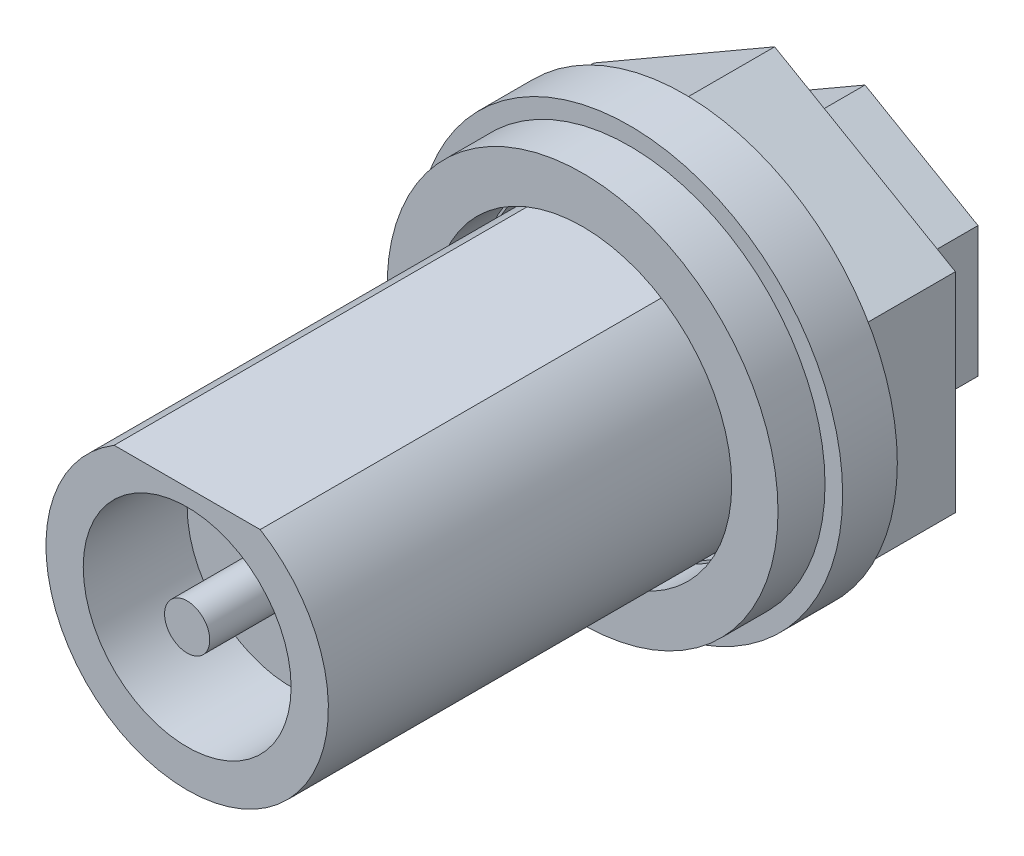
ISO-10303-21;
HEADER;
FILE_DESCRIPTION(('STEP AP214'),'2;1');
FILE_NAME('part.step','',(''),(''),'','','');
FILE_SCHEMA(('AUTOMOTIVE_DESIGN { 1 0 10303 214 1 1 1 1 }'));
ENDSEC;
DATA;
#1=APPLICATION_CONTEXT('core data for automotive mechanical design processes');
#2=APPLICATION_PROTOCOL_DEFINITION('international standard','automotive_design',2000,#1);
#3=PRODUCT_CONTEXT('',#1,'mechanical');
#4=PRODUCT('Part','Part','',(#3));
#5=PRODUCT_RELATED_PRODUCT_CATEGORY('part','',(#4));
#6=PRODUCT_DEFINITION_FORMATION('','',#4);
#7=PRODUCT_DEFINITION_CONTEXT('part definition',#1,'design');
#8=PRODUCT_DEFINITION('design','',#6,#7);
#9=PRODUCT_DEFINITION_SHAPE('','',#8);
#10=(LENGTH_UNIT() NAMED_UNIT(*) SI_UNIT(.MILLI.,.METRE.));
#11=(NAMED_UNIT(*) PLANE_ANGLE_UNIT() SI_UNIT($,.RADIAN.));
#12=(NAMED_UNIT(*) SI_UNIT($,.STERADIAN.) SOLID_ANGLE_UNIT());
#13=UNCERTAINTY_MEASURE_WITH_UNIT(LENGTH_MEASURE(1.E-05),#10,'distance_accuracy_value','');
#14=(GEOMETRIC_REPRESENTATION_CONTEXT(3) GLOBAL_UNCERTAINTY_ASSIGNED_CONTEXT((#13)) GLOBAL_UNIT_ASSIGNED_CONTEXT((#10,
#11,#12)) REPRESENTATION_CONTEXT('',''));
#15=CARTESIAN_POINT('',(0.,0.,0.));
#16=DIRECTION('',(0.,0.,1.));
#17=DIRECTION('',(1.,0.,0.));
#18=AXIS2_PLACEMENT_3D('',#15,#16,#17);
#19=CARTESIAN_POINT('',(0.,0.,0.));
#20=DIRECTION('',(0.,0.,1.));
#21=DIRECTION('',(1.,0.,0.));
#22=AXIS2_PLACEMENT_3D('',#19,#20,#21);
#23=PLANE('',#22);
#24=DIRECTION('',(-0.866025403784439,0.5,0.));
#25=VECTOR('',#24,1.);
#26=CARTESIAN_POINT('',(0.625,2.52590742770461,0.));
#27=LINE('',#26,#25);
#28=CARTESIAN_POINT('',(2.5,1.44337567297407,0.));
#29=VERTEX_POINT('',#28);
#30=CARTESIAN_POINT('',(0.,2.88675134594813,0.));
#31=VERTEX_POINT('',#30);
#32=EDGE_CURVE('E244',#29,#31,#27,.T.);
#33=ORIENTED_EDGE('',*,*,#32,.T.);
#34=DIRECTION('',(-0.866025403784439,-0.5,0.));
#35=VECTOR('',#34,1.);
#36=CARTESIAN_POINT('',(-1.875,1.80421959121758,0.));
#37=LINE('',#36,#35);
#38=CARTESIAN_POINT('',(-2.5,1.44337567297406,0.));
#39=VERTEX_POINT('',#38);
#40=EDGE_CURVE('E225',#31,#39,#37,.T.);
#41=ORIENTED_EDGE('',*,*,#40,.T.);
#42=DIRECTION('',(0.,-1.,0.));
#43=VECTOR('',#42,1.);
#44=CARTESIAN_POINT('',(-2.5,-0.721687836487033,0.));
#45=LINE('',#44,#43);
#46=CARTESIAN_POINT('',(-2.5,-1.44337567297407,0.));
#47=VERTEX_POINT('',#46);
#48=EDGE_CURVE('E343',#39,#47,#45,.T.);
#49=ORIENTED_EDGE('',*,*,#48,.T.);
#50=DIRECTION('',(0.866025403784439,-0.5,0.));
#51=VECTOR('',#50,1.);
#52=CARTESIAN_POINT('',(-0.625,-2.52590742770461,0.));
#53=LINE('',#52,#51);
#54=CARTESIAN_POINT('',(0.,-2.88675134594813,0.));
#55=VERTEX_POINT('',#54);
#56=EDGE_CURVE('E256',#47,#55,#53,.T.);
#57=ORIENTED_EDGE('',*,*,#56,.T.);
#58=DIRECTION('',(0.866025403784439,0.5,0.));
#59=VECTOR('',#58,1.);
#60=CARTESIAN_POINT('',(1.875,-1.80421959121758,0.));
#61=LINE('',#60,#59);
#62=CARTESIAN_POINT('',(2.5,-1.44337567297406,0.));
#63=VERTEX_POINT('',#62);
#64=EDGE_CURVE('E310',#55,#63,#61,.T.);
#65=ORIENTED_EDGE('',*,*,#64,.T.);
#66=DIRECTION('',(0.,1.,0.));
#67=VECTOR('',#66,1.);
#68=CARTESIAN_POINT('',(2.5,0.721687836487033,0.));
#69=LINE('',#68,#67);
#70=EDGE_CURVE('E221',#63,#29,#69,.T.);
#71=ORIENTED_EDGE('',*,*,#70,.T.);
#72=EDGE_LOOP('',(#33,#41,#49,#57,#65,#71));
#73=FACE_BOUND('',#72,.T.);
#74=DIRECTION('',(0.,1.,0.));
#75=VECTOR('',#74,1.);
#76=CARTESIAN_POINT('',(4.,-2.30940107675851,0.));
#77=LINE('',#76,#75);
#78=CARTESIAN_POINT('',(4.,-2.30940107675851,0.));
#79=VERTEX_POINT('',#78);
#80=CARTESIAN_POINT('',(4.,2.3094010767585,0.));
#81=VERTEX_POINT('',#80);
#82=EDGE_CURVE('E11',#79,#81,#77,.T.);
#83=ORIENTED_EDGE('',*,*,#82,.F.);
#84=DIRECTION('',(0.866025403784439,0.5,0.));
#85=VECTOR('',#84,1.);
#86=CARTESIAN_POINT('',(0.,-4.61880215351701,0.));
#87=LINE('',#86,#85);
#88=CARTESIAN_POINT('',(0.,-4.61880215351701,0.));
#89=VERTEX_POINT('',#88);
#90=EDGE_CURVE('E199',#89,#79,#87,.T.);
#91=ORIENTED_EDGE('',*,*,#90,.F.);
#92=DIRECTION('',(0.866025403784439,-0.5,0.));
#93=VECTOR('',#92,1.);
#94=CARTESIAN_POINT('',(-4.,-2.3094010767585,0.));
#95=LINE('',#94,#93);
#96=CARTESIAN_POINT('',(-4.,-2.3094010767585,0.));
#97=VERTEX_POINT('',#96);
#98=EDGE_CURVE('E311',#97,#89,#95,.T.);
#99=ORIENTED_EDGE('',*,*,#98,.F.);
#100=DIRECTION('',(0.,-1.,0.));
#101=VECTOR('',#100,1.);
#102=CARTESIAN_POINT('',(-4.,2.3094010767585,0.));
#103=LINE('',#102,#101);
#104=CARTESIAN_POINT('',(-4.,2.3094010767585,0.));
#105=VERTEX_POINT('',#104);
#106=EDGE_CURVE('E342',#105,#97,#103,.T.);
#107=ORIENTED_EDGE('',*,*,#106,.F.);
#108=DIRECTION('',(-0.866025403784439,-0.5,0.));
#109=VECTOR('',#108,1.);
#110=CARTESIAN_POINT('',(0.,4.61880215351701,0.));
#111=LINE('',#110,#109);
#112=CARTESIAN_POINT('',(0.,4.61880215351701,0.));
#113=VERTEX_POINT('',#112);
#114=EDGE_CURVE('E245',#113,#105,#111,.T.);
#115=ORIENTED_EDGE('',*,*,#114,.F.);
#116=DIRECTION('',(-0.866025403784439,0.5,0.));
#117=VECTOR('',#116,1.);
#118=CARTESIAN_POINT('',(4.,2.3094010767585,0.));
#119=LINE('',#118,#117);
#120=EDGE_CURVE('E201',#81,#113,#119,.T.);
#121=ORIENTED_EDGE('',*,*,#120,.F.);
#122=EDGE_LOOP('',(#83,#91,#99,#107,#115,#121));
#123=FACE_BOUND('',#122,.T.);
#124=ADVANCED_FACE('F17',(#73,#123),#23,.F.);
#125=CARTESIAN_POINT('',(0.,0.,2.));
#126=DIRECTION('',(0.,0.,1.));
#127=DIRECTION('',(1.,0.,0.));
#128=AXIS2_PLACEMENT_3D('',#125,#126,#127);
#129=PLANE('',#128);
#130=DIRECTION('',(1.,0.,0.));
#131=VECTOR('',#130,1.);
#132=CARTESIAN_POINT('',(0.807774721070176,2.675,2.));
#133=LINE('',#132,#131);
#134=CARTESIAN_POINT('',(-1.61554944214035,2.675,2.));
#135=VERTEX_POINT('',#134);
#136=CARTESIAN_POINT('',(1.61554944214035,2.675,2.));
#137=VERTEX_POINT('',#136);
#138=EDGE_CURVE('E272',#135,#137,#133,.T.);
#139=ORIENTED_EDGE('',*,*,#138,.T.);
#140=CARTESIAN_POINT('',(0.,0.,2.));
#141=DIRECTION('',(0.,0.,-1.));
#142=DIRECTION('',(-1.,0.,0.));
#143=AXIS2_PLACEMENT_3D('',#140,#141,#142);
#144=CIRCLE('',#143,3.125);
#145=EDGE_CURVE('E395',#137,#135,#144,.T.);
#146=ORIENTED_EDGE('',*,*,#145,.T.);
#147=EDGE_LOOP('',(#139,#146));
#148=FACE_BOUND('',#147,.T.);
#149=CARTESIAN_POINT('',(0.,0.,2.));
#150=DIRECTION('',(0.,0.,1.));
#151=DIRECTION('',(-1.,0.,0.));
#152=AXIS2_PLACEMENT_3D('',#149,#150,#151);
#153=CIRCLE('',#152,3.25);
#154=CARTESIAN_POINT('',(3.25,0.,2.));
#155=VERTEX_POINT('',#154);
#156=EDGE_CURVE('E302',#155,#155,#153,.T.);
#157=ORIENTED_EDGE('',*,*,#156,.T.);
#158=EDGE_LOOP('',(#157));
#159=FACE_BOUND('',#158,.T.);
#160=ADVANCED_FACE('F458',(#148,#159),#129,.T.);
#161=CARTESIAN_POINT('',(4.,-2.30940107675851,0.));
#162=DIRECTION('',(1.,0.,0.));
#163=DIRECTION('',(0.,-1.,0.));
#164=AXIS2_PLACEMENT_3D('',#161,#162,#163);
#165=PLANE('',#164);
#166=ORIENTED_EDGE('',*,*,#82,.T.);
#167=DIRECTION('',(0.,0.,1.));
#168=VECTOR('',#167,1.);
#169=CARTESIAN_POINT('',(4.,2.3094010767585,0.));
#170=LINE('',#169,#168);
#171=CARTESIAN_POINT('',(4.,2.3094010767585,2.));
#172=VERTEX_POINT('',#171);
#173=EDGE_CURVE('E27',#81,#172,#170,.T.);
#174=ORIENTED_EDGE('',*,*,#173,.T.);
#175=DIRECTION('',(0.,1.,0.));
#176=VECTOR('',#175,1.);
#177=CARTESIAN_POINT('',(4.,-2.30940107675851,2.));
#178=LINE('',#177,#176);
#179=CARTESIAN_POINT('',(4.,-2.30940107675851,2.));
#180=VERTEX_POINT('',#179);
#181=EDGE_CURVE('E206',#180,#172,#178,.T.);
#182=ORIENTED_EDGE('',*,*,#181,.F.);
#183=DIRECTION('',(0.,0.,1.));
#184=VECTOR('',#183,1.);
#185=CARTESIAN_POINT('',(4.,-2.30940107675851,0.));
#186=LINE('',#185,#184);
#187=EDGE_CURVE('E203',#79,#180,#186,.T.);
#188=ORIENTED_EDGE('',*,*,#187,.F.);
#189=EDGE_LOOP('',(#166,#174,#182,#188));
#190=FACE_BOUND('',#189,.T.);
#191=ADVANCED_FACE('F204',(#190),#165,.T.);
#192=CARTESIAN_POINT('',(4.,2.3094010767585,0.));
#193=DIRECTION('',(0.5,0.866025403784439,0.));
#194=DIRECTION('',(0.,0.,-1.));
#195=AXIS2_PLACEMENT_3D('',#192,#193,#194);
#196=PLANE('',#195);
#197=ORIENTED_EDGE('',*,*,#120,.T.);
#198=DIRECTION('',(0.,0.,1.));
#199=VECTOR('',#198,1.);
#200=CARTESIAN_POINT('',(0.,4.61880215351701,0.));
#201=LINE('',#200,#199);
#202=CARTESIAN_POINT('',(0.,4.61880215351701,2.));
#203=VERTEX_POINT('',#202);
#204=EDGE_CURVE('E228',#113,#203,#201,.T.);
#205=ORIENTED_EDGE('',*,*,#204,.T.);
#206=DIRECTION('',(-0.866025403784439,0.5,0.));
#207=VECTOR('',#206,1.);
#208=CARTESIAN_POINT('',(4.,2.3094010767585,2.));
#209=LINE('',#208,#207);
#210=EDGE_CURVE('E323',#172,#203,#209,.T.);
#211=ORIENTED_EDGE('',*,*,#210,.F.);
#212=ORIENTED_EDGE('',*,*,#173,.F.);
#213=EDGE_LOOP('',(#197,#205,#211,#212));
#214=FACE_BOUND('',#213,.T.);
#215=ADVANCED_FACE('F469',(#214),#196,.T.);
#216=CARTESIAN_POINT('',(0.,4.61880215351701,0.));
#217=DIRECTION('',(-0.5,0.866025403784439,0.));
#218=DIRECTION('',(0.,0.,1.));
#219=AXIS2_PLACEMENT_3D('',#216,#217,#218);
#220=PLANE('',#219);
#221=ORIENTED_EDGE('',*,*,#114,.T.);
#222=DIRECTION('',(0.,0.,1.));
#223=VECTOR('',#222,1.);
#224=CARTESIAN_POINT('',(-4.,2.3094010767585,0.));
#225=LINE('',#224,#223);
#226=CARTESIAN_POINT('',(-4.,2.3094010767585,2.));
#227=VERTEX_POINT('',#226);
#228=EDGE_CURVE('E248',#105,#227,#225,.T.);
#229=ORIENTED_EDGE('',*,*,#228,.T.);
#230=DIRECTION('',(-0.866025403784439,-0.5,0.));
#231=VECTOR('',#230,1.);
#232=CARTESIAN_POINT('',(0.,4.61880215351701,2.));
#233=LINE('',#232,#231);
#234=EDGE_CURVE('E339',#203,#227,#233,.T.);
#235=ORIENTED_EDGE('',*,*,#234,.F.);
#236=ORIENTED_EDGE('',*,*,#204,.F.);
#237=EDGE_LOOP('',(#221,#229,#235,#236));
#238=FACE_BOUND('',#237,.T.);
#239=ADVANCED_FACE('F504',(#238),#220,.T.);
#240=CARTESIAN_POINT('',(-4.,2.3094010767585,0.));
#241=DIRECTION('',(-1.,0.,0.));
#242=DIRECTION('',(0.,0.,1.));
#243=AXIS2_PLACEMENT_3D('',#240,#241,#242);
#244=PLANE('',#243);
#245=ORIENTED_EDGE('',*,*,#106,.T.);
#246=DIRECTION('',(0.,0.,1.));
#247=VECTOR('',#246,1.);
#248=CARTESIAN_POINT('',(-4.,-2.3094010767585,0.));
#249=LINE('',#248,#247);
#250=CARTESIAN_POINT('',(-4.,-2.3094010767585,2.));
#251=VERTEX_POINT('',#250);
#252=EDGE_CURVE('E313',#97,#251,#249,.T.);
#253=ORIENTED_EDGE('',*,*,#252,.T.);
#254=DIRECTION('',(0.,-1.,0.));
#255=VECTOR('',#254,1.);
#256=CARTESIAN_POINT('',(-4.,2.3094010767585,2.));
#257=LINE('',#256,#255);
#258=EDGE_CURVE('E362',#227,#251,#257,.T.);
#259=ORIENTED_EDGE('',*,*,#258,.F.);
#260=ORIENTED_EDGE('',*,*,#228,.F.);
#261=EDGE_LOOP('',(#245,#253,#259,#260));
#262=FACE_BOUND('',#261,.T.);
#263=ADVANCED_FACE('F474',(#262),#244,.T.);
#264=CARTESIAN_POINT('',(-4.,-2.3094010767585,0.));
#265=DIRECTION('',(-0.5,-0.866025403784439,0.));
#266=DIRECTION('',(-0.866025403784439,0.5,0.));
#267=AXIS2_PLACEMENT_3D('',#264,#265,#266);
#268=PLANE('',#267);
#269=ORIENTED_EDGE('',*,*,#98,.T.);
#270=DIRECTION('',(0.,0.,1.));
#271=VECTOR('',#270,1.);
#272=CARTESIAN_POINT('',(0.,-4.61880215351701,0.));
#273=LINE('',#272,#271);
#274=CARTESIAN_POINT('',(0.,-4.61880215351701,2.));
#275=VERTEX_POINT('',#274);
#276=EDGE_CURVE('E211',#89,#275,#273,.T.);
#277=ORIENTED_EDGE('',*,*,#276,.T.);
#278=DIRECTION('',(0.866025403784439,-0.5,0.));
#279=VECTOR('',#278,1.);
#280=CARTESIAN_POINT('',(-4.,-2.3094010767585,2.));
#281=LINE('',#280,#279);
#282=EDGE_CURVE('E262',#251,#275,#281,.T.);
#283=ORIENTED_EDGE('',*,*,#282,.F.);
#284=ORIENTED_EDGE('',*,*,#252,.F.);
#285=EDGE_LOOP('',(#269,#277,#283,#284));
#286=FACE_BOUND('',#285,.T.);
#287=ADVANCED_FACE('F527',(#286),#268,.T.);
#288=CARTESIAN_POINT('',(0.,-4.61880215351701,0.));
#289=DIRECTION('',(0.5,-0.866025403784439,0.));
#290=DIRECTION('',(0.,0.,-1.));
#291=AXIS2_PLACEMENT_3D('',#288,#289,#290);
#292=PLANE('',#291);
#293=ORIENTED_EDGE('',*,*,#90,.T.);
#294=ORIENTED_EDGE('',*,*,#187,.T.);
#295=DIRECTION('',(0.866025403784439,0.5,0.));
#296=VECTOR('',#295,1.);
#297=CARTESIAN_POINT('',(0.,-4.61880215351701,2.));
#298=LINE('',#297,#296);
#299=EDGE_CURVE('E314',#275,#180,#298,.T.);
#300=ORIENTED_EDGE('',*,*,#299,.F.);
#301=ORIENTED_EDGE('',*,*,#276,.F.);
#302=EDGE_LOOP('',(#293,#294,#300,#301));
#303=FACE_BOUND('',#302,.T.);
#304=ADVANCED_FACE('F214',(#303),#292,.T.);
#305=CARTESIAN_POINT('',(0.,0.,-2.));
#306=DIRECTION('',(0.,0.,-1.));
#307=DIRECTION('',(0.,-1.,0.));
#308=AXIS2_PLACEMENT_3D('',#305,#306,#307);
#309=PLANE('',#308);
#310=DIRECTION('',(0.,-1.,0.));
#311=VECTOR('',#310,1.);
#312=CARTESIAN_POINT('',(2.5,1.44337567297407,-2.));
#313=LINE('',#312,#311);
#314=CARTESIAN_POINT('',(2.5,1.44337567297407,-2.));
#315=VERTEX_POINT('',#314);
#316=CARTESIAN_POINT('',(2.5,-1.44337567297406,-2.));
#317=VERTEX_POINT('',#316);
#318=EDGE_CURVE('E85',#315,#317,#313,.T.);
#319=ORIENTED_EDGE('',*,*,#318,.T.);
#320=DIRECTION('',(-0.866025403784439,-0.5,0.));
#321=VECTOR('',#320,1.);
#322=CARTESIAN_POINT('',(2.5,-1.44337567297406,-2.));
#323=LINE('',#322,#321);
#324=CARTESIAN_POINT('',(0.,-2.88675134594813,-2.));
#325=VERTEX_POINT('',#324);
#326=EDGE_CURVE('E307',#317,#325,#323,.T.);
#327=ORIENTED_EDGE('',*,*,#326,.T.);
#328=DIRECTION('',(-0.866025403784439,0.5,0.));
#329=VECTOR('',#328,1.);
#330=CARTESIAN_POINT('',(0.,-2.88675134594813,-2.));
#331=LINE('',#330,#329);
#332=CARTESIAN_POINT('',(-2.5,-1.44337567297406,-2.));
#333=VERTEX_POINT('',#332);
#334=EDGE_CURVE('E252',#325,#333,#331,.T.);
#335=ORIENTED_EDGE('',*,*,#334,.T.);
#336=DIRECTION('',(0.,1.,0.));
#337=VECTOR('',#336,1.);
#338=CARTESIAN_POINT('',(-2.5,-1.44337567297407,-2.));
#339=LINE('',#338,#337);
#340=CARTESIAN_POINT('',(-2.5,1.44337567297406,-2.));
#341=VERTEX_POINT('',#340);
#342=EDGE_CURVE('E291',#333,#341,#339,.T.);
#343=ORIENTED_EDGE('',*,*,#342,.T.);
#344=DIRECTION('',(0.866025403784439,0.5,0.));
#345=VECTOR('',#344,1.);
#346=CARTESIAN_POINT('',(-2.5,1.44337567297406,-2.));
#347=LINE('',#346,#345);
#348=CARTESIAN_POINT('',(0.,2.88675134594813,-2.));
#349=VERTEX_POINT('',#348);
#350=EDGE_CURVE('E69',#341,#349,#347,.T.);
#351=ORIENTED_EDGE('',*,*,#350,.T.);
#352=DIRECTION('',(0.866025403784439,-0.5,0.));
#353=VECTOR('',#352,1.);
#354=CARTESIAN_POINT('',(0.,2.88675134594813,-2.));
#355=LINE('',#354,#353);
#356=EDGE_CURVE('E243',#349,#315,#355,.T.);
#357=ORIENTED_EDGE('',*,*,#356,.T.);
#358=EDGE_LOOP('',(#319,#327,#335,#343,#351,#357));
#359=FACE_BOUND('',#358,.T.);
#360=ADVANCED_FACE('F431',(#359),#309,.T.);
#361=CARTESIAN_POINT('',(2.5,1.44337567297407,0.));
#362=DIRECTION('',(1.,0.,0.));
#363=DIRECTION('',(0.,1.,0.));
#364=AXIS2_PLACEMENT_3D('',#361,#362,#363);
#365=PLANE('',#364);
#366=ORIENTED_EDGE('',*,*,#70,.F.);
#367=DIRECTION('',(0.,0.,-1.));
#368=VECTOR('',#367,1.);
#369=CARTESIAN_POINT('',(2.5,-1.44337567297406,0.));
#370=LINE('',#369,#368);
#371=EDGE_CURVE('E295',#63,#317,#370,.T.);
#372=ORIENTED_EDGE('',*,*,#371,.T.);
#373=ORIENTED_EDGE('',*,*,#318,.F.);
#374=DIRECTION('',(0.,0.,-1.));
#375=VECTOR('',#374,1.);
#376=CARTESIAN_POINT('',(2.5,1.44337567297407,0.));
#377=LINE('',#376,#375);
#378=EDGE_CURVE('E239',#29,#315,#377,.T.);
#379=ORIENTED_EDGE('',*,*,#378,.F.);
#380=EDGE_LOOP('',(#366,#372,#373,#379));
#381=FACE_BOUND('',#380,.T.);
#382=ADVANCED_FACE('F434',(#381),#365,.T.);
#383=CARTESIAN_POINT('',(2.5,-1.44337567297406,0.));
#384=DIRECTION('',(0.5,-0.866025403784439,0.));
#385=DIRECTION('',(0.,0.,-1.));
#386=AXIS2_PLACEMENT_3D('',#383,#384,#385);
#387=PLANE('',#386);
#388=ORIENTED_EDGE('',*,*,#64,.F.);
#389=DIRECTION('',(0.,0.,-1.));
#390=VECTOR('',#389,1.);
#391=CARTESIAN_POINT('',(0.,-2.88675134594813,0.));
#392=LINE('',#391,#390);
#393=EDGE_CURVE('E255',#55,#325,#392,.T.);
#394=ORIENTED_EDGE('',*,*,#393,.T.);
#395=ORIENTED_EDGE('',*,*,#326,.F.);
#396=ORIENTED_EDGE('',*,*,#371,.F.);
#397=EDGE_LOOP('',(#388,#394,#395,#396));
#398=FACE_BOUND('',#397,.T.);
#399=ADVANCED_FACE('F436',(#398),#387,.T.);
#400=CARTESIAN_POINT('',(0.,-2.88675134594813,0.));
#401=DIRECTION('',(-0.5,-0.866025403784439,0.));
#402=DIRECTION('',(-0.866025403784439,0.5,0.));
#403=AXIS2_PLACEMENT_3D('',#400,#401,#402);
#404=PLANE('',#403);
#405=ORIENTED_EDGE('',*,*,#56,.F.);
#406=DIRECTION('',(0.,0.,-1.));
#407=VECTOR('',#406,1.);
#408=CARTESIAN_POINT('',(-2.5,-1.44337567297407,0.));
#409=LINE('',#408,#407);
#410=EDGE_CURVE('E288',#47,#333,#409,.T.);
#411=ORIENTED_EDGE('',*,*,#410,.T.);
#412=ORIENTED_EDGE('',*,*,#334,.F.);
#413=ORIENTED_EDGE('',*,*,#393,.F.);
#414=EDGE_LOOP('',(#405,#411,#412,#413));
#415=FACE_BOUND('',#414,.T.);
#416=ADVANCED_FACE('F440',(#415),#404,.T.);
#417=CARTESIAN_POINT('',(-2.5,-1.44337567297407,0.));
#418=DIRECTION('',(-1.,0.,0.));
#419=DIRECTION('',(0.,1.,0.));
#420=AXIS2_PLACEMENT_3D('',#417,#418,#419);
#421=PLANE('',#420);
#422=ORIENTED_EDGE('',*,*,#48,.F.);
#423=DIRECTION('',(0.,0.,-1.));
#424=VECTOR('',#423,1.);
#425=CARTESIAN_POINT('',(-2.5,1.44337567297406,0.));
#426=LINE('',#425,#424);
#427=EDGE_CURVE('E347',#39,#341,#426,.T.);
#428=ORIENTED_EDGE('',*,*,#427,.T.);
#429=ORIENTED_EDGE('',*,*,#342,.F.);
#430=ORIENTED_EDGE('',*,*,#410,.F.);
#431=EDGE_LOOP('',(#422,#428,#429,#430));
#432=FACE_BOUND('',#431,.T.);
#433=ADVANCED_FACE('F444',(#432),#421,.T.);
#434=CARTESIAN_POINT('',(-2.5,1.44337567297406,0.));
#435=DIRECTION('',(-0.5,0.866025403784439,0.));
#436=DIRECTION('',(0.,0.,1.));
#437=AXIS2_PLACEMENT_3D('',#434,#435,#436);
#438=PLANE('',#437);
#439=ORIENTED_EDGE('',*,*,#40,.F.);
#440=DIRECTION('',(0.,0.,-1.));
#441=VECTOR('',#440,1.);
#442=CARTESIAN_POINT('',(0.,2.88675134594813,0.));
#443=LINE('',#442,#441);
#444=EDGE_CURVE('E251',#31,#349,#443,.T.);
#445=ORIENTED_EDGE('',*,*,#444,.T.);
#446=ORIENTED_EDGE('',*,*,#350,.F.);
#447=ORIENTED_EDGE('',*,*,#427,.F.);
#448=EDGE_LOOP('',(#439,#445,#446,#447));
#449=FACE_BOUND('',#448,.T.);
#450=ADVANCED_FACE('F428',(#449),#438,.T.);
#451=CARTESIAN_POINT('',(0.,2.88675134594813,0.));
#452=DIRECTION('',(0.5,0.866025403784439,0.));
#453=DIRECTION('',(0.,0.,-1.));
#454=AXIS2_PLACEMENT_3D('',#451,#452,#453);
#455=PLANE('',#454);
#456=ORIENTED_EDGE('',*,*,#32,.F.);
#457=ORIENTED_EDGE('',*,*,#378,.T.);
#458=ORIENTED_EDGE('',*,*,#356,.F.);
#459=ORIENTED_EDGE('',*,*,#444,.F.);
#460=EDGE_LOOP('',(#456,#457,#458,#459));
#461=FACE_BOUND('',#460,.T.);
#462=ADVANCED_FACE('F430',(#461),#455,.T.);
#463=CARTESIAN_POINT('',(0.,-0.225,13.));
#464=DIRECTION('',(0.,0.,1.));
#465=DIRECTION('',(1.,0.,0.));
#466=AXIS2_PLACEMENT_3D('',#463,#464,#465);
#467=PLANE('',#466);
#468=CARTESIAN_POINT('',(0.,0.,13.));
#469=DIRECTION('',(0.,0.,1.));
#470=DIRECTION('',(-1.,0.,0.));
#471=AXIS2_PLACEMENT_3D('',#468,#469,#470);
#472=CIRCLE('',#471,0.5);
#473=CARTESIAN_POINT('',(0.5,0.,13.));
#474=VERTEX_POINT('',#473);
#475=EDGE_CURVE('E283',#474,#474,#472,.T.);
#476=ORIENTED_EDGE('',*,*,#475,.T.);
#477=EDGE_LOOP('',(#476));
#478=FACE_BOUND('',#477,.T.);
#479=ADVANCED_FACE('F486',(#478),#467,.T.);
#480=CARTESIAN_POINT('',(0.,0.,2.));
#481=DIRECTION('',(0.,0.,1.));
#482=DIRECTION('',(0.,-1.,0.));
#483=AXIS2_PLACEMENT_3D('',#480,#481,#482);
#484=CYLINDRICAL_SURFACE('',#483,3.125);
#485=ORIENTED_EDGE('',*,*,#145,.F.);
#486=DIRECTION('',(0.,0.,1.));
#487=VECTOR('',#486,1.);
#488=CARTESIAN_POINT('',(1.61554944214035,2.675,2.));
#489=LINE('',#488,#487);
#490=CARTESIAN_POINT('',(1.61554944214035,2.675,13.));
#491=VERTEX_POINT('',#490);
#492=EDGE_CURVE('E20',#137,#491,#489,.T.);
#493=ORIENTED_EDGE('',*,*,#492,.T.);
#494=CARTESIAN_POINT('',(0.,0.,13.));
#495=DIRECTION('',(0.,0.,1.));
#496=DIRECTION('',(-1.,0.,0.));
#497=AXIS2_PLACEMENT_3D('',#494,#495,#496);
#498=CIRCLE('',#497,3.125);
#499=CARTESIAN_POINT('',(-1.61554944214035,2.675,13.));
#500=VERTEX_POINT('',#499);
#501=EDGE_CURVE('E273',#500,#491,#498,.T.);
#502=ORIENTED_EDGE('',*,*,#501,.F.);
#503=DIRECTION('',(0.,0.,1.));
#504=VECTOR('',#503,1.);
#505=CARTESIAN_POINT('',(-1.61554944214035,2.675,2.));
#506=LINE('',#505,#504);
#507=EDGE_CURVE('E277',#135,#500,#506,.T.);
#508=ORIENTED_EDGE('',*,*,#507,.F.);
#509=EDGE_LOOP('',(#485,#493,#502,#508));
#510=FACE_BOUND('',#509,.T.);
#511=ADVANCED_FACE('F482',(#510),#484,.T.);
#512=CARTESIAN_POINT('',(1.61554944214035,2.675,2.));
#513=DIRECTION('',(0.,1.,0.));
#514=DIRECTION('',(1.,0.,0.));
#515=AXIS2_PLACEMENT_3D('',#512,#513,#514);
#516=PLANE('',#515);
#517=ORIENTED_EDGE('',*,*,#138,.F.);
#518=ORIENTED_EDGE('',*,*,#507,.T.);
#519=DIRECTION('',(-1.,0.,0.));
#520=VECTOR('',#519,1.);
#521=CARTESIAN_POINT('',(-2.56443627278528,2.675,13.));
#522=LINE('',#521,#520);
#523=EDGE_CURVE('E268',#491,#500,#522,.T.);
#524=ORIENTED_EDGE('',*,*,#523,.F.);
#525=ORIENTED_EDGE('',*,*,#492,.F.);
#526=EDGE_LOOP('',(#517,#518,#524,#525));
#527=FACE_BOUND('',#526,.T.);
#528=ADVANCED_FACE('F485',(#527),#516,.T.);
#529=CARTESIAN_POINT('',(0.,-0.225,13.));
#530=DIRECTION('',(0.,0.,1.));
#531=DIRECTION('',(1.,0.,0.));
#532=AXIS2_PLACEMENT_3D('',#529,#530,#531);
#533=PLANE('',#532);
#534=CARTESIAN_POINT('',(0.,0.,13.));
#535=DIRECTION('',(0.,0.,-1.));
#536=DIRECTION('',(-1.,0.,0.));
#537=AXIS2_PLACEMENT_3D('',#534,#535,#536);
#538=CIRCLE('',#537,2.3);
#539=CARTESIAN_POINT('',(2.3,0.,13.));
#540=VERTEX_POINT('',#539);
#541=EDGE_CURVE('E266',#540,#540,#538,.T.);
#542=ORIENTED_EDGE('',*,*,#541,.T.);
#543=EDGE_LOOP('',(#542));
#544=FACE_BOUND('',#543,.T.);
#545=ORIENTED_EDGE('',*,*,#501,.T.);
#546=ORIENTED_EDGE('',*,*,#523,.T.);
#547=EDGE_LOOP('',(#545,#546));
#548=FACE_BOUND('',#547,.T.);
#549=ADVANCED_FACE('F493',(#544,#548),#533,.T.);
#550=CARTESIAN_POINT('',(0.,0.,10.7));
#551=DIRECTION('',(0.,0.,1.));
#552=DIRECTION('',(1.,0.,0.));
#553=AXIS2_PLACEMENT_3D('',#550,#551,#552);
#554=PLANE('',#553);
#555=CARTESIAN_POINT('',(0.,0.,10.7));
#556=DIRECTION('',(0.,0.,1.));
#557=DIRECTION('',(-1.,0.,0.));
#558=AXIS2_PLACEMENT_3D('',#555,#556,#557);
#559=CIRCLE('',#558,0.5);
#560=CARTESIAN_POINT('',(0.5,0.,10.7));
#561=VERTEX_POINT('',#560);
#562=EDGE_CURVE('E263',#561,#561,#559,.T.);
#563=ORIENTED_EDGE('',*,*,#562,.F.);
#564=EDGE_LOOP('',(#563));
#565=FACE_BOUND('',#564,.T.);
#566=CARTESIAN_POINT('',(0.,0.,10.7));
#567=DIRECTION('',(0.,0.,-1.));
#568=DIRECTION('',(-1.,0.,0.));
#569=AXIS2_PLACEMENT_3D('',#566,#567,#568);
#570=CIRCLE('',#569,2.3);
#571=CARTESIAN_POINT('',(2.3,0.,10.7));
#572=VERTEX_POINT('',#571);
#573=EDGE_CURVE('E306',#572,#572,#570,.T.);
#574=ORIENTED_EDGE('',*,*,#573,.F.);
#575=EDGE_LOOP('',(#574));
#576=FACE_BOUND('',#575,.T.);
#577=ADVANCED_FACE('F497',(#565,#576),#554,.T.);
#578=CARTESIAN_POINT('',(0.,0.,13.));
#579=DIRECTION('',(0.,0.,-1.));
#580=DIRECTION('',(-1.,0.,0.));
#581=AXIS2_PLACEMENT_3D('',#578,#579,#580);
#582=CYLINDRICAL_SURFACE('',#581,2.3);
#583=ORIENTED_EDGE('',*,*,#541,.F.);
#584=DIRECTION('',(0.,0.,-1.));
#585=VECTOR('',#584,1.);
#586=CARTESIAN_POINT('',(2.3,0.,13.));
#587=LINE('',#586,#585);
#588=EDGE_CURVE('E299',#540,#572,#587,.T.);
#589=ORIENTED_EDGE('',*,*,#588,.T.);
#590=ORIENTED_EDGE('',*,*,#573,.T.);
#591=ORIENTED_EDGE('',*,*,#588,.F.);
#592=EDGE_LOOP('',(#583,#589,#590,#591));
#593=FACE_BOUND('',#592,.T.);
#594=ADVANCED_FACE('F500',(#593),#582,.F.);
#595=CARTESIAN_POINT('',(0.,0.,13.));
#596=DIRECTION('',(0.,0.,-1.));
#597=DIRECTION('',(-1.,0.,0.));
#598=AXIS2_PLACEMENT_3D('',#595,#596,#597);
#599=CYLINDRICAL_SURFACE('',#598,0.5);
#600=ORIENTED_EDGE('',*,*,#475,.F.);
#601=DIRECTION('',(0.,0.,-1.));
#602=VECTOR('',#601,1.);
#603=CARTESIAN_POINT('',(0.5,0.,13.));
#604=LINE('',#603,#602);
#605=EDGE_CURVE('E267',#474,#561,#604,.T.);
#606=ORIENTED_EDGE('',*,*,#605,.T.);
#607=ORIENTED_EDGE('',*,*,#562,.T.);
#608=ORIENTED_EDGE('',*,*,#605,.F.);
#609=EDGE_LOOP('',(#600,#606,#607,#608));
#610=FACE_BOUND('',#609,.T.);
#611=ADVANCED_FACE('F513',(#610),#599,.T.);
#612=CARTESIAN_POINT('',(0.,0.,3.21));
#613=DIRECTION('',(0.,0.,1.));
#614=DIRECTION('',(1.,0.,0.));
#615=AXIS2_PLACEMENT_3D('',#612,#613,#614);
#616=PLANE('',#615);
#617=CARTESIAN_POINT('',(0.,0.,3.21));
#618=DIRECTION('',(0.,0.,-1.));
#619=DIRECTION('',(-1.,0.,0.));
#620=AXIS2_PLACEMENT_3D('',#617,#618,#619);
#621=CIRCLE('',#620,3.25);
#622=CARTESIAN_POINT('',(3.25,0.,3.21));
#623=VERTEX_POINT('',#622);
#624=EDGE_CURVE('E257',#623,#623,#621,.T.);
#625=ORIENTED_EDGE('',*,*,#624,.T.);
#626=EDGE_LOOP('',(#625));
#627=FACE_BOUND('',#626,.T.);
#628=CARTESIAN_POINT('',(0.,0.,3.21));
#629=DIRECTION('',(0.,0.,1.));
#630=DIRECTION('',(-1.,0.,0.));
#631=AXIS2_PLACEMENT_3D('',#628,#629,#630);
#632=CIRCLE('',#631,3.3);
#633=CARTESIAN_POINT('',(3.3,0.,3.21));
#634=VERTEX_POINT('',#633);
#635=EDGE_CURVE('E238',#634,#634,#632,.T.);
#636=ORIENTED_EDGE('',*,*,#635,.T.);
#637=EDGE_LOOP('',(#636));
#638=FACE_BOUND('',#637,.T.);
#639=ADVANCED_FACE('F519',(#627,#638),#616,.T.);
#640=CARTESIAN_POINT('',(0.,0.,2.));
#641=DIRECTION('',(0.,0.,1.));
#642=DIRECTION('',(-1.,0.,0.));
#643=AXIS2_PLACEMENT_3D('',#640,#641,#642);
#644=CYLINDRICAL_SURFACE('',#643,4.715);
#645=CARTESIAN_POINT('',(0.,0.,3.21));
#646=DIRECTION('',(0.,0.,1.));
#647=DIRECTION('',(-1.,0.,0.));
#648=AXIS2_PLACEMENT_3D('',#645,#646,#647);
#649=CIRCLE('',#648,4.715);
#650=CARTESIAN_POINT('',(4.715,0.,3.21));
#651=VERTEX_POINT('',#650);
#652=EDGE_CURVE('E326',#651,#651,#649,.T.);
#653=ORIENTED_EDGE('',*,*,#652,.F.);
#654=DIRECTION('',(0.,0.,-1.));
#655=VECTOR('',#654,1.);
#656=CARTESIAN_POINT('',(4.715,0.,2.));
#657=LINE('',#656,#655);
#658=CARTESIAN_POINT('',(4.715,0.,2.));
#659=VERTEX_POINT('',#658);
#660=EDGE_CURVE('E287',#651,#659,#657,.T.);
#661=ORIENTED_EDGE('',*,*,#660,.T.);
#662=CARTESIAN_POINT('',(0.,0.,2.));
#663=DIRECTION('',(0.,0.,1.));
#664=DIRECTION('',(-1.,0.,0.));
#665=AXIS2_PLACEMENT_3D('',#662,#663,#664);
#666=CIRCLE('',#665,4.715);
#667=EDGE_CURVE('E316',#659,#659,#666,.T.);
#668=ORIENTED_EDGE('',*,*,#667,.T.);
#669=ORIENTED_EDGE('',*,*,#660,.F.);
#670=EDGE_LOOP('',(#653,#661,#668,#669));
#671=FACE_BOUND('',#670,.T.);
#672=ADVANCED_FACE('F522',(#671),#644,.T.);
#673=CARTESIAN_POINT('',(0.,0.,2.));
#674=DIRECTION('',(0.,0.,1.));
#675=DIRECTION('',(-1.,0.,0.));
#676=AXIS2_PLACEMENT_3D('',#673,#674,#675);
#677=CYLINDRICAL_SURFACE('',#676,3.25);
#678=ORIENTED_EDGE('',*,*,#624,.F.);
#679=DIRECTION('',(0.,0.,-1.));
#680=VECTOR('',#679,1.);
#681=CARTESIAN_POINT('',(3.25,0.,2.));
#682=LINE('',#681,#680);
#683=EDGE_CURVE('E261',#623,#155,#682,.T.);
#684=ORIENTED_EDGE('',*,*,#683,.T.);
#685=ORIENTED_EDGE('',*,*,#156,.F.);
#686=ORIENTED_EDGE('',*,*,#683,.F.);
#687=EDGE_LOOP('',(#678,#684,#685,#686));
#688=FACE_BOUND('',#687,.T.);
#689=ADVANCED_FACE('F540',(#688),#677,.F.);
#690=CARTESIAN_POINT('',(0.,0.,2.));
#691=DIRECTION('',(0.,0.,1.));
#692=DIRECTION('',(1.,0.,0.));
#693=AXIS2_PLACEMENT_3D('',#690,#691,#692);
#694=PLANE('',#693);
#695=ORIENTED_EDGE('',*,*,#299,.T.);
#696=ORIENTED_EDGE('',*,*,#181,.T.);
#697=ORIENTED_EDGE('',*,*,#210,.T.);
#698=ORIENTED_EDGE('',*,*,#234,.T.);
#699=ORIENTED_EDGE('',*,*,#258,.T.);
#700=ORIENTED_EDGE('',*,*,#282,.T.);
#701=EDGE_LOOP('',(#695,#696,#697,#698,#699,#700));
#702=FACE_BOUND('',#701,.T.);
#703=ORIENTED_EDGE('',*,*,#667,.F.);
#704=EDGE_LOOP('',(#703));
#705=FACE_BOUND('',#704,.T.);
#706=ADVANCED_FACE('F480',(#702,#705),#694,.F.);
#707=CARTESIAN_POINT('',(0.,0.,3.21));
#708=DIRECTION('',(0.,0.,1.));
#709=DIRECTION('',(1.,0.,0.));
#710=AXIS2_PLACEMENT_3D('',#707,#708,#709);
#711=PLANE('',#710);
#712=CARTESIAN_POINT('',(0.,0.,3.21));
#713=DIRECTION('',(0.,0.,-1.));
#714=DIRECTION('',(-1.,0.,0.));
#715=AXIS2_PLACEMENT_3D('',#712,#713,#714);
#716=CIRCLE('',#715,4.325);
#717=CARTESIAN_POINT('',(4.325,0.,3.21));
#718=VERTEX_POINT('',#717);
#719=EDGE_CURVE('E233',#718,#718,#716,.T.);
#720=ORIENTED_EDGE('',*,*,#719,.T.);
#721=EDGE_LOOP('',(#720));
#722=FACE_BOUND('',#721,.T.);
#723=ORIENTED_EDGE('',*,*,#652,.T.);
#724=EDGE_LOOP('',(#723));
#725=FACE_BOUND('',#724,.T.);
#726=ADVANCED_FACE('F476',(#722,#725),#711,.T.);
#727=CARTESIAN_POINT('',(0.,0.,4.25));
#728=DIRECTION('',(0.,0.,1.));
#729=DIRECTION('',(1.,0.,0.));
#730=AXIS2_PLACEMENT_3D('',#727,#728,#729);
#731=PLANE('',#730);
#732=CARTESIAN_POINT('',(0.,0.,4.25));
#733=DIRECTION('',(0.,0.,-1.));
#734=DIRECTION('',(-1.,0.,0.));
#735=AXIS2_PLACEMENT_3D('',#732,#733,#734);
#736=CIRCLE('',#735,3.3);
#737=CARTESIAN_POINT('',(3.3,0.,4.25));
#738=VERTEX_POINT('',#737);
#739=EDGE_CURVE('E282',#738,#738,#736,.T.);
#740=ORIENTED_EDGE('',*,*,#739,.T.);
#741=EDGE_LOOP('',(#740));
#742=FACE_BOUND('',#741,.T.);
#743=CARTESIAN_POINT('',(0.,0.,4.25));
#744=DIRECTION('',(0.,0.,1.));
#745=DIRECTION('',(-1.,0.,0.));
#746=AXIS2_PLACEMENT_3D('',#743,#744,#745);
#747=CIRCLE('',#746,4.325);
#748=CARTESIAN_POINT('',(4.325,0.,4.25));
#749=VERTEX_POINT('',#748);
#750=EDGE_CURVE('E234',#749,#749,#747,.T.);
#751=ORIENTED_EDGE('',*,*,#750,.T.);
#752=EDGE_LOOP('',(#751));
#753=FACE_BOUND('',#752,.T.);
#754=ADVANCED_FACE('F479',(#742,#753),#731,.T.);
#755=CARTESIAN_POINT('',(0.,0.,3.21));
#756=DIRECTION('',(0.,0.,1.));
#757=DIRECTION('',(-1.,0.,0.));
#758=AXIS2_PLACEMENT_3D('',#755,#756,#757);
#759=CYLINDRICAL_SURFACE('',#758,4.325);
#760=ORIENTED_EDGE('',*,*,#750,.F.);
#761=DIRECTION('',(0.,0.,-1.));
#762=VECTOR('',#761,1.);
#763=CARTESIAN_POINT('',(4.325,0.,3.21));
#764=LINE('',#763,#762);
#765=EDGE_CURVE('E229',#749,#718,#764,.T.);
#766=ORIENTED_EDGE('',*,*,#765,.T.);
#767=ORIENTED_EDGE('',*,*,#719,.F.);
#768=ORIENTED_EDGE('',*,*,#765,.F.);
#769=EDGE_LOOP('',(#760,#766,#767,#768));
#770=FACE_BOUND('',#769,.T.);
#771=ADVANCED_FACE('F517',(#770),#759,.T.);
#772=CARTESIAN_POINT('',(0.,0.,3.21));
#773=DIRECTION('',(0.,0.,1.));
#774=DIRECTION('',(-1.,0.,0.));
#775=AXIS2_PLACEMENT_3D('',#772,#773,#774);
#776=CYLINDRICAL_SURFACE('',#775,3.3);
#777=ORIENTED_EDGE('',*,*,#739,.F.);
#778=DIRECTION('',(0.,0.,-1.));
#779=VECTOR('',#778,1.);
#780=CARTESIAN_POINT('',(3.3,0.,3.21));
#781=LINE('',#780,#779);
#782=EDGE_CURVE('E278',#738,#634,#781,.T.);
#783=ORIENTED_EDGE('',*,*,#782,.T.);
#784=ORIENTED_EDGE('',*,*,#635,.F.);
#785=ORIENTED_EDGE('',*,*,#782,.F.);
#786=EDGE_LOOP('',(#777,#783,#784,#785));
#787=FACE_BOUND('',#786,.T.);
#788=ADVANCED_FACE('F544',(#787),#776,.F.);
#789=CLOSED_SHELL('',(#124,#160,#191,#215,#239,#263,#287,#304,#360,#382,#399,#416,#433,#450,
#462,#479,#511,#528,#549,#577,#594,#611,#639,#672,#689,#706,#726,#754,#771,#788));
#790=MANIFOLD_SOLID_BREP('B1',#789);
#791=ADVANCED_BREP_SHAPE_REPRESENTATION('',(#18,#790),#14);
#792=SHAPE_DEFINITION_REPRESENTATION(#9,#791);
ENDSEC;
END-ISO-10303-21;
